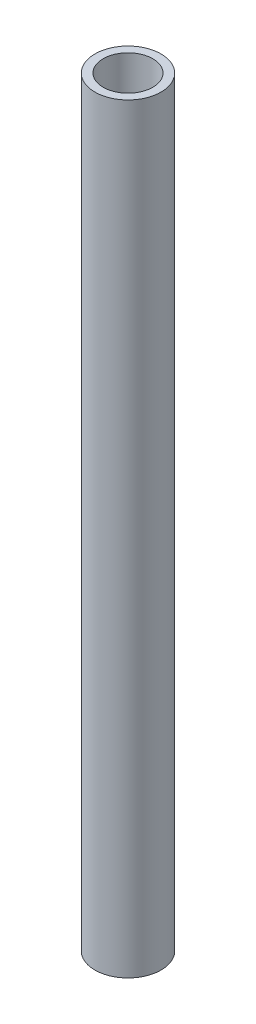
ISO-10303-21;
HEADER;
FILE_DESCRIPTION(('STEP AP214'),'2;1');
FILE_NAME('part.step','',(''),(''),'','','');
FILE_SCHEMA(('AUTOMOTIVE_DESIGN { 1 0 10303 214 1 1 1 1 }'));
ENDSEC;
DATA;
#1=APPLICATION_CONTEXT('core data for automotive mechanical design processes');
#2=APPLICATION_PROTOCOL_DEFINITION('international standard','automotive_design',2000,#1);
#3=PRODUCT_CONTEXT('',#1,'mechanical');
#4=PRODUCT('Part','Part','',(#3));
#5=PRODUCT_RELATED_PRODUCT_CATEGORY('part','',(#4));
#6=PRODUCT_DEFINITION_FORMATION('','',#4);
#7=PRODUCT_DEFINITION_CONTEXT('part definition',#1,'design');
#8=PRODUCT_DEFINITION('design','',#6,#7);
#9=PRODUCT_DEFINITION_SHAPE('','',#8);
#10=(LENGTH_UNIT() NAMED_UNIT(*) SI_UNIT(.MILLI.,.METRE.));
#11=(NAMED_UNIT(*) PLANE_ANGLE_UNIT() SI_UNIT($,.RADIAN.));
#12=(NAMED_UNIT(*) SI_UNIT($,.STERADIAN.) SOLID_ANGLE_UNIT());
#13=UNCERTAINTY_MEASURE_WITH_UNIT(LENGTH_MEASURE(1.E-05),#10,'distance_accuracy_value','');
#14=(GEOMETRIC_REPRESENTATION_CONTEXT(3) GLOBAL_UNCERTAINTY_ASSIGNED_CONTEXT((#13)) GLOBAL_UNIT_ASSIGNED_CONTEXT((#10,
#11,#12)) REPRESENTATION_CONTEXT('',''));
#15=CARTESIAN_POINT('',(0.,0.,0.));
#16=DIRECTION('',(0.,0.,1.));
#17=DIRECTION('',(1.,0.,0.));
#18=AXIS2_PLACEMENT_3D('',#15,#16,#17);
#19=CARTESIAN_POINT('',(0.,292.1,0.));
#20=DIRECTION('',(0.,1.,0.));
#21=DIRECTION('',(0.,0.,1.));
#22=AXIS2_PLACEMENT_3D('',#19,#20,#21);
#23=PLANE('',#22);
#24=CARTESIAN_POINT('',(0.,292.1,0.));
#25=DIRECTION('',(0.,1.,0.));
#26=DIRECTION('',(0.,0.,1.));
#27=AXIS2_PLACEMENT_3D('',#24,#25,#26);
#28=CIRCLE('',#27,12.7);
#29=CARTESIAN_POINT('',(0.,292.1,12.7));
#30=VERTEX_POINT('',#29);
#31=EDGE_CURVE('E10',#30,#30,#28,.T.);
#32=ORIENTED_EDGE('',*,*,#31,.T.);
#33=EDGE_LOOP('',(#32));
#34=FACE_BOUND('',#33,.T.);
#35=CARTESIAN_POINT('',(0.,292.1,0.));
#36=DIRECTION('',(0.,1.,0.));
#37=DIRECTION('',(0.,0.,1.));
#38=AXIS2_PLACEMENT_3D('',#35,#36,#37);
#39=CIRCLE('',#38,9.525);
#40=CARTESIAN_POINT('',(0.,292.1,9.525));
#41=VERTEX_POINT('',#40);
#42=EDGE_CURVE('E43',#41,#41,#39,.T.);
#43=ORIENTED_EDGE('',*,*,#42,.F.);
#44=EDGE_LOOP('',(#43));
#45=FACE_BOUND('',#44,.T.);
#46=ADVANCED_FACE('F32',(#34,#45),#23,.T.);
#47=CARTESIAN_POINT('',(0.,0.,0.));
#48=DIRECTION('',(0.,1.,0.));
#49=DIRECTION('',(0.,0.,1.));
#50=AXIS2_PLACEMENT_3D('',#47,#48,#49);
#51=PLANE('',#50);
#52=CARTESIAN_POINT('',(0.,0.,0.));
#53=DIRECTION('',(0.,1.,0.));
#54=DIRECTION('',(0.,0.,1.));
#55=AXIS2_PLACEMENT_3D('',#52,#53,#54);
#56=CIRCLE('',#55,12.7);
#57=CARTESIAN_POINT('',(0.,0.,12.7));
#58=VERTEX_POINT('',#57);
#59=EDGE_CURVE('E36',#58,#58,#56,.T.);
#60=ORIENTED_EDGE('',*,*,#59,.F.);
#61=EDGE_LOOP('',(#60));
#62=FACE_BOUND('',#61,.T.);
#63=CARTESIAN_POINT('',(0.,0.,0.));
#64=DIRECTION('',(0.,1.,0.));
#65=DIRECTION('',(0.,0.,1.));
#66=AXIS2_PLACEMENT_3D('',#63,#64,#65);
#67=CIRCLE('',#66,9.525);
#68=CARTESIAN_POINT('',(0.,0.,9.525));
#69=VERTEX_POINT('',#68);
#70=EDGE_CURVE('E45',#69,#69,#67,.T.);
#71=ORIENTED_EDGE('',*,*,#70,.T.);
#72=EDGE_LOOP('',(#71));
#73=FACE_BOUND('',#72,.T.);
#74=ADVANCED_FACE('F55',(#62,#73),#51,.F.);
#75=CARTESIAN_POINT('',(0.,292.1,0.));
#76=DIRECTION('',(0.,-1.,0.));
#77=DIRECTION('',(0.,0.,-1.));
#78=AXIS2_PLACEMENT_3D('',#75,#76,#77);
#79=CYLINDRICAL_SURFACE('',#78,12.7);
#80=ORIENTED_EDGE('',*,*,#31,.F.);
#81=EDGE_LOOP('',(#80));
#82=FACE_BOUND('',#81,.T.);
#83=ORIENTED_EDGE('',*,*,#59,.T.);
#84=EDGE_LOOP('',(#83));
#85=FACE_BOUND('',#84,.T.);
#86=ADVANCED_FACE('F34',(#82,#85),#79,.T.);
#87=CARTESIAN_POINT('',(0.,292.1,0.));
#88=DIRECTION('',(0.,-1.,0.));
#89=DIRECTION('',(0.,0.,-1.));
#90=AXIS2_PLACEMENT_3D('',#87,#88,#89);
#91=CYLINDRICAL_SURFACE('',#90,9.525);
#92=ORIENTED_EDGE('',*,*,#42,.T.);
#93=EDGE_LOOP('',(#92));
#94=FACE_BOUND('',#93,.T.);
#95=ORIENTED_EDGE('',*,*,#70,.F.);
#96=EDGE_LOOP('',(#95));
#97=FACE_BOUND('',#96,.T.);
#98=ADVANCED_FACE('F51',(#94,#97),#91,.F.);
#99=CLOSED_SHELL('',(#46,#74,#86,#98));
#100=MANIFOLD_SOLID_BREP('B2',#99);
#101=ADVANCED_BREP_SHAPE_REPRESENTATION('',(#18,#100),#14);
#102=SHAPE_DEFINITION_REPRESENTATION(#9,#101);
ENDSEC;
END-ISO-10303-21;
